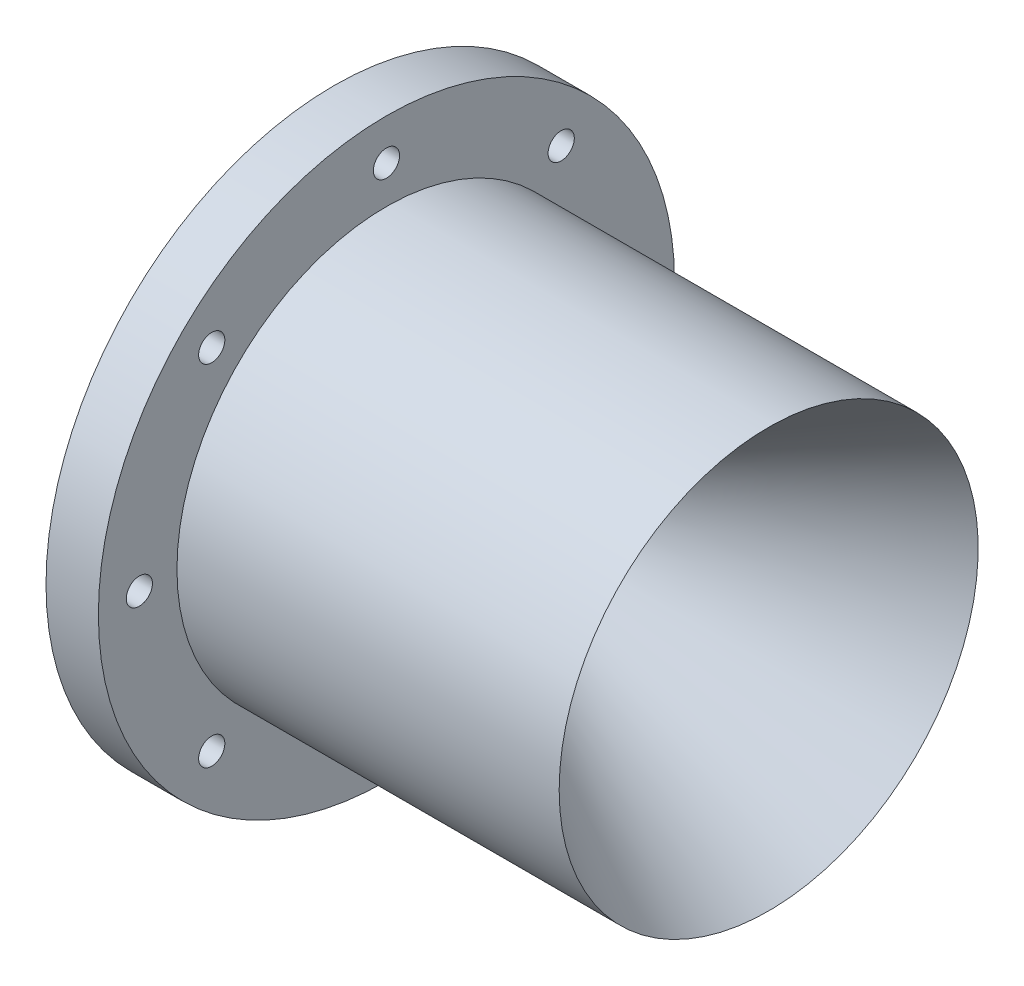
ISO-10303-21;
HEADER;
FILE_DESCRIPTION(('STEP AP214'),'2;1');
FILE_NAME('part.step','',(''),(''),'','','');
FILE_SCHEMA(('AUTOMOTIVE_DESIGN { 1 0 10303 214 1 1 1 1 }'));
ENDSEC;
DATA;
#1=APPLICATION_CONTEXT('core data for automotive mechanical design processes');
#2=APPLICATION_PROTOCOL_DEFINITION('international standard','automotive_design',2000,#1);
#3=PRODUCT_CONTEXT('',#1,'mechanical');
#4=PRODUCT('Part','Part','',(#3));
#5=PRODUCT_RELATED_PRODUCT_CATEGORY('part','',(#4));
#6=PRODUCT_DEFINITION_FORMATION('','',#4);
#7=PRODUCT_DEFINITION_CONTEXT('part definition',#1,'design');
#8=PRODUCT_DEFINITION('design','',#6,#7);
#9=PRODUCT_DEFINITION_SHAPE('','',#8);
#10=(LENGTH_UNIT() NAMED_UNIT(*) SI_UNIT(.MILLI.,.METRE.));
#11=(NAMED_UNIT(*) PLANE_ANGLE_UNIT() SI_UNIT($,.RADIAN.));
#12=(NAMED_UNIT(*) SI_UNIT($,.STERADIAN.) SOLID_ANGLE_UNIT());
#13=UNCERTAINTY_MEASURE_WITH_UNIT(LENGTH_MEASURE(1.E-05),#10,'distance_accuracy_value','');
#14=(GEOMETRIC_REPRESENTATION_CONTEXT(3) GLOBAL_UNCERTAINTY_ASSIGNED_CONTEXT((#13)) GLOBAL_UNIT_ASSIGNED_CONTEXT((#10,
#11,#12)) REPRESENTATION_CONTEXT('',''));
#15=CARTESIAN_POINT('',(0.,0.,0.));
#16=DIRECTION('',(0.,0.,1.));
#17=DIRECTION('',(1.,0.,0.));
#18=AXIS2_PLACEMENT_3D('',#15,#16,#17);
#19=CARTESIAN_POINT('',(-33.0472668619156,50.8,0.));
#20=DIRECTION('',(1.,0.,0.));
#21=DIRECTION('',(0.,0.,-1.));
#22=AXIS2_PLACEMENT_3D('',#19,#20,#21);
#23=PLANE('',#22);
#24=CARTESIAN_POINT('',(-33.0472668619156,0.,0.));
#25=DIRECTION('',(-1.,0.,0.));
#26=DIRECTION('',(0.,0.,1.));
#27=AXIS2_PLACEMENT_3D('',#24,#25,#26);
#28=CIRCLE('',#27,41.275);
#29=CARTESIAN_POINT('',(-33.0472668619156,0.,41.275));
#30=VERTEX_POINT('',#29);
#31=EDGE_CURVE('E55',#30,#30,#28,.T.);
#32=ORIENTED_EDGE('',*,*,#31,.F.);
#33=EDGE_LOOP('',(#32));
#34=FACE_BOUND('',#33,.T.);
#35=CARTESIAN_POINT('',(-33.0472668619156,0.,0.));
#36=DIRECTION('',(-1.,0.,0.));
#37=DIRECTION('',(0.,0.,1.));
#38=AXIS2_PLACEMENT_3D('',#35,#36,#37);
#39=CIRCLE('',#38,47.625);
#40=CARTESIAN_POINT('',(-33.0472668619156,0.,47.625));
#41=VERTEX_POINT('',#40);
#42=EDGE_CURVE('E68',#41,#41,#39,.T.);
#43=ORIENTED_EDGE('',*,*,#42,.T.);
#44=EDGE_LOOP('',(#43));
#45=FACE_BOUND('',#44,.T.);
#46=ADVANCED_FACE('F32',(#34,#45),#23,.F.);
#47=CARTESIAN_POINT('',(0.,0.,0.));
#48=DIRECTION('',(-1.,0.,0.));
#49=DIRECTION('',(0.,0.,1.));
#50=AXIS2_PLACEMENT_3D('',#47,#48,#49);
#51=CYLINDRICAL_SURFACE('',#50,7.9375);
#52=CARTESIAN_POINT('',(0.,0.,0.));
#53=DIRECTION('',(-1.,0.,0.));
#54=DIRECTION('',(0.,0.,1.));
#55=AXIS2_PLACEMENT_3D('',#52,#53,#54);
#56=CIRCLE('',#55,7.9375);
#57=CARTESIAN_POINT('',(0.,0.,7.9375));
#58=VERTEX_POINT('',#57);
#59=EDGE_CURVE('E10',#58,#58,#56,.T.);
#60=ORIENTED_EDGE('',*,*,#59,.F.);
#61=EDGE_LOOP('',(#60));
#62=FACE_BOUND('',#61,.T.);
#63=CARTESIAN_POINT('',(-12.7,0.,0.));
#64=DIRECTION('',(-1.,0.,0.));
#65=DIRECTION('',(0.,0.,1.));
#66=AXIS2_PLACEMENT_3D('',#63,#64,#65);
#67=CIRCLE('',#66,7.9375);
#68=CARTESIAN_POINT('',(-12.7,0.,7.9375));
#69=VERTEX_POINT('',#68);
#70=EDGE_CURVE('E58',#69,#69,#67,.T.);
#71=ORIENTED_EDGE('',*,*,#70,.T.);
#72=EDGE_LOOP('',(#71));
#73=FACE_BOUND('',#72,.T.);
#74=ADVANCED_FACE('F34',(#62,#73),#51,.F.);
#75=CARTESIAN_POINT('',(0.,0.,0.));
#76=DIRECTION('',(1.,0.,0.));
#77=DIRECTION('',(0.,0.,-1.));
#78=AXIS2_PLACEMENT_3D('',#75,#76,#77);
#79=CONICAL_SURFACE('',#78,7.9375,0.534993353531431);
#80=CARTESIAN_POINT('',(72.3241560558228,0.,0.));
#81=DIRECTION('',(-1.,0.,0.));
#82=DIRECTION('',(0.,0.,1.));
#83=AXIS2_PLACEMENT_3D('',#80,#81,#82);
#84=CIRCLE('',#83,50.8);
#85=CARTESIAN_POINT('',(72.3241560558228,0.,50.8));
#86=VERTEX_POINT('',#85);
#87=EDGE_CURVE('E39',#86,#86,#84,.T.);
#88=ORIENTED_EDGE('',*,*,#87,.F.);
#89=EDGE_LOOP('',(#88));
#90=FACE_BOUND('',#89,.T.);
#91=ORIENTED_EDGE('',*,*,#59,.T.);
#92=EDGE_LOOP('',(#91));
#93=FACE_BOUND('',#92,.T.);
#94=ADVANCED_FACE('F163',(#90,#93),#79,.F.);
#95=CARTESIAN_POINT('',(0.,0.,0.));
#96=DIRECTION('',(-1.,0.,0.));
#97=DIRECTION('',(0.,0.,1.));
#98=AXIS2_PLACEMENT_3D('',#95,#96,#97);
#99=CYLINDRICAL_SURFACE('',#98,50.8);
#100=CARTESIAN_POINT('',(-20.3472668619156,0.,0.));
#101=DIRECTION('',(-1.,0.,0.));
#102=DIRECTION('',(0.,0.,1.));
#103=AXIS2_PLACEMENT_3D('',#100,#101,#102);
#104=CIRCLE('',#103,50.8);
#105=CARTESIAN_POINT('',(-20.3472668619156,0.,50.8));
#106=VERTEX_POINT('',#105);
#107=EDGE_CURVE('E43',#106,#106,#104,.T.);
#108=ORIENTED_EDGE('',*,*,#107,.F.);
#109=EDGE_LOOP('',(#108));
#110=FACE_BOUND('',#109,.T.);
#111=ORIENTED_EDGE('',*,*,#87,.T.);
#112=EDGE_LOOP('',(#111));
#113=FACE_BOUND('',#112,.T.);
#114=ADVANCED_FACE('F157',(#110,#113),#99,.T.);
#115=CARTESIAN_POINT('',(-20.3472668619156,69.85,0.));
#116=DIRECTION('',(-1.,0.,0.));
#117=DIRECTION('',(0.,0.,1.));
#118=AXIS2_PLACEMENT_3D('',#115,#116,#117);
#119=PLANE('',#118);
#120=CARTESIAN_POINT('',(-20.3472668619156,59.9186,0.));
#121=DIRECTION('',(-1.,0.,0.));
#122=DIRECTION('',(0.,0.,1.));
#123=AXIS2_PLACEMENT_3D('',#120,#121,#122);
#124=CIRCLE('',#123,3.175);
#125=CARTESIAN_POINT('',(-20.3472668619156,59.9186,3.175));
#126=VERTEX_POINT('',#125);
#127=EDGE_CURVE('E71',#126,#126,#124,.F.);
#128=ORIENTED_EDGE('',*,*,#127,.F.);
#129=EDGE_LOOP('',(#128));
#130=FACE_BOUND('',#129,.T.);
#131=CARTESIAN_POINT('',(-20.3472668619156,42.3688483792054,42.3688483792047));
#132=DIRECTION('',(-1.,0.,0.));
#133=DIRECTION('',(0.,0.,1.));
#134=AXIS2_PLACEMENT_3D('',#131,#132,#133);
#135=CIRCLE('',#134,3.17500000000024);
#136=CARTESIAN_POINT('',(-20.3472668619156,42.3688483792054,45.543848379205));
#137=VERTEX_POINT('',#136);
#138=EDGE_CURVE('E111',#137,#137,#135,.F.);
#139=ORIENTED_EDGE('',*,*,#138,.F.);
#140=EDGE_LOOP('',(#139));
#141=FACE_BOUND('',#140,.T.);
#142=CARTESIAN_POINT('',(-20.3472668619156,1.61747136534687E-12,59.9186000000016));
#143=DIRECTION('',(-1.,0.,0.));
#144=DIRECTION('',(0.,0.,1.));
#145=AXIS2_PLACEMENT_3D('',#142,#143,#144);
#146=CIRCLE('',#145,3.175);
#147=CARTESIAN_POINT('',(-20.3472668619156,1.61747136534687E-12,63.0936000000016));
#148=VERTEX_POINT('',#147);
#149=EDGE_CURVE('E105',#148,#148,#146,.F.);
#150=ORIENTED_EDGE('',*,*,#149,.F.);
#151=EDGE_LOOP('',(#150));
#152=FACE_BOUND('',#151,.T.);
#153=CARTESIAN_POINT('',(-20.3472668619156,-42.3688483792031,42.368848379207));
#154=DIRECTION('',(-1.,0.,0.));
#155=DIRECTION('',(0.,0.,1.));
#156=AXIS2_PLACEMENT_3D('',#153,#154,#155);
#157=CIRCLE('',#156,3.175);
#158=CARTESIAN_POINT('',(-20.3472668619156,-42.3688483792031,45.543848379207));
#159=VERTEX_POINT('',#158);
#160=EDGE_CURVE('E99',#159,#159,#157,.F.);
#161=ORIENTED_EDGE('',*,*,#160,.F.);
#162=EDGE_LOOP('',(#161));
#163=FACE_BOUND('',#162,.T.);
#164=CARTESIAN_POINT('',(-20.3472668619156,-59.9186,3.23494273069374E-12));
#165=DIRECTION('',(-1.,0.,0.));
#166=DIRECTION('',(0.,0.,1.));
#167=AXIS2_PLACEMENT_3D('',#164,#165,#166);
#168=CIRCLE('',#167,3.175);
#169=CARTESIAN_POINT('',(-20.3472668619156,-59.9186,3.17500000000323));
#170=VERTEX_POINT('',#169);
#171=EDGE_CURVE('E93',#170,#170,#168,.F.);
#172=ORIENTED_EDGE('',*,*,#171,.F.);
#173=EDGE_LOOP('',(#172));
#174=FACE_BOUND('',#173,.T.);
#175=CARTESIAN_POINT('',(-20.3472668619156,-42.3688483792054,-42.3688483792015));
#176=DIRECTION('',(-1.,0.,0.));
#177=DIRECTION('',(0.,0.,1.));
#178=AXIS2_PLACEMENT_3D('',#175,#176,#177);
#179=CIRCLE('',#178,3.175);
#180=CARTESIAN_POINT('',(-20.3472668619156,-42.3688483792054,-39.1938483792015));
#181=VERTEX_POINT('',#180);
#182=EDGE_CURVE('E87',#181,#181,#179,.F.);
#183=ORIENTED_EDGE('',*,*,#182,.F.);
#184=EDGE_LOOP('',(#183));
#185=FACE_BOUND('',#184,.T.);
#186=CARTESIAN_POINT('',(-20.3472668619156,-1.62480927751681E-12,-59.9185999999984));
#187=DIRECTION('',(-1.,0.,0.));
#188=DIRECTION('',(0.,0.,1.));
#189=AXIS2_PLACEMENT_3D('',#186,#187,#188);
#190=CIRCLE('',#189,3.175);
#191=CARTESIAN_POINT('',(-20.3472668619156,-1.62480927751681E-12,-56.7435999999984));
#192=VERTEX_POINT('',#191);
#193=EDGE_CURVE('E81',#192,#192,#190,.F.);
#194=ORIENTED_EDGE('',*,*,#193,.F.);
#195=EDGE_LOOP('',(#194));
#196=FACE_BOUND('',#195,.T.);
#197=CARTESIAN_POINT('',(-20.3472668619156,42.3688483792031,-42.3688483792038));
#198=DIRECTION('',(-1.,0.,0.));
#199=DIRECTION('',(0.,0.,1.));
#200=AXIS2_PLACEMENT_3D('',#197,#198,#199);
#201=CIRCLE('',#200,3.175);
#202=CARTESIAN_POINT('',(-20.3472668619156,42.3688483792031,-39.1938483792038));
#203=VERTEX_POINT('',#202);
#204=EDGE_CURVE('E74',#203,#203,#201,.F.);
#205=ORIENTED_EDGE('',*,*,#204,.F.);
#206=EDGE_LOOP('',(#205));
#207=FACE_BOUND('',#206,.T.);
#208=CARTESIAN_POINT('',(-20.3472668619156,0.,0.));
#209=DIRECTION('',(-1.,0.,0.));
#210=DIRECTION('',(0.,0.,1.));
#211=AXIS2_PLACEMENT_3D('',#208,#209,#210);
#212=CIRCLE('',#211,69.85);
#213=CARTESIAN_POINT('',(-20.3472668619156,0.,69.85));
#214=VERTEX_POINT('',#213);
#215=EDGE_CURVE('E47',#214,#214,#212,.T.);
#216=ORIENTED_EDGE('',*,*,#215,.F.);
#217=EDGE_LOOP('',(#216));
#218=FACE_BOUND('',#217,.T.);
#219=ORIENTED_EDGE('',*,*,#107,.T.);
#220=EDGE_LOOP('',(#219));
#221=FACE_BOUND('',#220,.T.);
#222=ADVANCED_FACE('F151',(#130,#141,#152,#163,#174,#185,#196,#207,#218,#221),#119,.F.);
#223=CARTESIAN_POINT('',(0.,0.,0.));
#224=DIRECTION('',(-1.,0.,0.));
#225=DIRECTION('',(0.,0.,1.));
#226=AXIS2_PLACEMENT_3D('',#223,#224,#225);
#227=CYLINDRICAL_SURFACE('',#226,69.85);
#228=CARTESIAN_POINT('',(-33.0472668619156,0.,0.));
#229=DIRECTION('',(-1.,0.,0.));
#230=DIRECTION('',(0.,0.,1.));
#231=AXIS2_PLACEMENT_3D('',#228,#229,#230);
#232=CIRCLE('',#231,69.85);
#233=CARTESIAN_POINT('',(-33.0472668619156,0.,69.85));
#234=VERTEX_POINT('',#233);
#235=EDGE_CURVE('E52',#234,#234,#232,.T.);
#236=ORIENTED_EDGE('',*,*,#235,.F.);
#237=EDGE_LOOP('',(#236));
#238=FACE_BOUND('',#237,.T.);
#239=ORIENTED_EDGE('',*,*,#215,.T.);
#240=EDGE_LOOP('',(#239));
#241=FACE_BOUND('',#240,.T.);
#242=ADVANCED_FACE('F129',(#238,#241),#227,.T.);
#243=CARTESIAN_POINT('',(-33.0472668619156,59.9186,0.));
#244=DIRECTION('',(-1.,0.,0.));
#245=DIRECTION('',(0.,0.,1.));
#246=AXIS2_PLACEMENT_3D('',#243,#244,#245);
#247=CIRCLE('',#246,3.175);
#248=CARTESIAN_POINT('',(-33.0472668619156,59.9186,3.175));
#249=VERTEX_POINT('',#248);
#250=EDGE_CURVE('E114',#249,#249,#247,.T.);
#251=ORIENTED_EDGE('',*,*,#250,.F.);
#252=EDGE_LOOP('',(#251));
#253=FACE_BOUND('',#252,.T.);
#254=CARTESIAN_POINT('',(-33.0472668619156,42.3688483792054,42.3688483792047));
#255=DIRECTION('',(-1.,0.,0.));
#256=DIRECTION('',(0.,0.,1.));
#257=AXIS2_PLACEMENT_3D('',#254,#255,#256);
#258=CIRCLE('',#257,3.17500000000024);
#259=CARTESIAN_POINT('',(-33.0472668619156,42.3688483792054,45.543848379205));
#260=VERTEX_POINT('',#259);
#261=EDGE_CURVE('E108',#260,#260,#258,.T.);
#262=ORIENTED_EDGE('',*,*,#261,.F.);
#263=EDGE_LOOP('',(#262));
#264=FACE_BOUND('',#263,.T.);
#265=CARTESIAN_POINT('',(-33.0472668619156,1.61747136534687E-12,59.9186000000016));
#266=DIRECTION('',(-1.,0.,0.));
#267=DIRECTION('',(0.,0.,1.));
#268=AXIS2_PLACEMENT_3D('',#265,#266,#267);
#269=CIRCLE('',#268,3.175);
#270=CARTESIAN_POINT('',(-33.0472668619156,1.61747136534687E-12,63.0936000000016));
#271=VERTEX_POINT('',#270);
#272=EDGE_CURVE('E102',#271,#271,#269,.T.);
#273=ORIENTED_EDGE('',*,*,#272,.F.);
#274=EDGE_LOOP('',(#273));
#275=FACE_BOUND('',#274,.T.);
#276=CARTESIAN_POINT('',(-33.0472668619156,-42.3688483792031,42.368848379207));
#277=DIRECTION('',(-1.,0.,0.));
#278=DIRECTION('',(0.,0.,1.));
#279=AXIS2_PLACEMENT_3D('',#276,#277,#278);
#280=CIRCLE('',#279,3.175);
#281=CARTESIAN_POINT('',(-33.0472668619156,-42.3688483792031,45.543848379207));
#282=VERTEX_POINT('',#281);
#283=EDGE_CURVE('E96',#282,#282,#280,.T.);
#284=ORIENTED_EDGE('',*,*,#283,.F.);
#285=EDGE_LOOP('',(#284));
#286=FACE_BOUND('',#285,.T.);
#287=CARTESIAN_POINT('',(-33.0472668619156,-59.9186,3.23494273069374E-12));
#288=DIRECTION('',(-1.,0.,0.));
#289=DIRECTION('',(0.,0.,1.));
#290=AXIS2_PLACEMENT_3D('',#287,#288,#289);
#291=CIRCLE('',#290,3.175);
#292=CARTESIAN_POINT('',(-33.0472668619156,-59.9186,3.17500000000323));
#293=VERTEX_POINT('',#292);
#294=EDGE_CURVE('E90',#293,#293,#291,.T.);
#295=ORIENTED_EDGE('',*,*,#294,.F.);
#296=EDGE_LOOP('',(#295));
#297=FACE_BOUND('',#296,.T.);
#298=CARTESIAN_POINT('',(-33.0472668619156,-42.3688483792054,-42.3688483792015));
#299=DIRECTION('',(-1.,0.,0.));
#300=DIRECTION('',(0.,0.,1.));
#301=AXIS2_PLACEMENT_3D('',#298,#299,#300);
#302=CIRCLE('',#301,3.175);
#303=CARTESIAN_POINT('',(-33.0472668619156,-42.3688483792054,-39.1938483792015));
#304=VERTEX_POINT('',#303);
#305=EDGE_CURVE('E84',#304,#304,#302,.T.);
#306=ORIENTED_EDGE('',*,*,#305,.F.);
#307=EDGE_LOOP('',(#306));
#308=FACE_BOUND('',#307,.T.);
#309=CARTESIAN_POINT('',(-33.0472668619156,-1.62480927751681E-12,-59.9185999999984));
#310=DIRECTION('',(-1.,0.,0.));
#311=DIRECTION('',(0.,0.,1.));
#312=AXIS2_PLACEMENT_3D('',#309,#310,#311);
#313=CIRCLE('',#312,3.175);
#314=CARTESIAN_POINT('',(-33.0472668619156,-1.62480927751681E-12,-56.7435999999984));
#315=VERTEX_POINT('',#314);
#316=EDGE_CURVE('E77',#315,#315,#313,.T.);
#317=ORIENTED_EDGE('',*,*,#316,.F.);
#318=EDGE_LOOP('',(#317));
#319=FACE_BOUND('',#318,.T.);
#320=CARTESIAN_POINT('',(-33.0472668619156,42.3688483792031,-42.3688483792038));
#321=DIRECTION('',(-1.,0.,0.));
#322=DIRECTION('',(0.,0.,1.));
#323=AXIS2_PLACEMENT_3D('',#320,#321,#322);
#324=CIRCLE('',#323,3.175);
#325=CARTESIAN_POINT('',(-33.0472668619156,42.3688483792031,-39.1938483792038));
#326=VERTEX_POINT('',#325);
#327=EDGE_CURVE('E78',#326,#326,#324,.T.);
#328=ORIENTED_EDGE('',*,*,#327,.F.);
#329=EDGE_LOOP('',(#328));
#330=FACE_BOUND('',#329,.T.);
#331=CARTESIAN_POINT('',(-33.0472668619156,0.,0.));
#332=DIRECTION('',(-1.,0.,0.));
#333=DIRECTION('',(0.,0.,1.));
#334=AXIS2_PLACEMENT_3D('',#331,#332,#333);
#335=CIRCLE('',#334,49.53);
#336=CARTESIAN_POINT('',(-33.0472668619156,0.,49.53));
#337=VERTEX_POINT('',#336);
#338=EDGE_CURVE('E62',#337,#337,#335,.T.);
#339=ORIENTED_EDGE('',*,*,#338,.F.);
#340=EDGE_LOOP('',(#339));
#341=FACE_BOUND('',#340,.T.);
#342=ORIENTED_EDGE('',*,*,#235,.T.);
#343=EDGE_LOOP('',(#342));
#344=FACE_BOUND('',#343,.T.);
#345=ADVANCED_FACE('F125',(#253,#264,#275,#286,#297,#308,#319,#330,#341,#344),#23,.F.);
#346=CARTESIAN_POINT('',(-33.0472668619156,0.,0.));
#347=DIRECTION('',(-1.,0.,0.));
#348=DIRECTION('',(0.,0.,1.));
#349=AXIS2_PLACEMENT_3D('',#346,#347,#348);
#350=CONICAL_SURFACE('',#349,41.275,1.02280730700641);
#351=ORIENTED_EDGE('',*,*,#70,.F.);
#352=EDGE_LOOP('',(#351));
#353=FACE_BOUND('',#352,.T.);
#354=ORIENTED_EDGE('',*,*,#31,.T.);
#355=EDGE_LOOP('',(#354));
#356=FACE_BOUND('',#355,.T.);
#357=ADVANCED_FACE('F128',(#353,#356),#350,.F.);
#358=CARTESIAN_POINT('',(-31.9296668619156,0.,0.));
#359=DIRECTION('',(-1.,0.,0.));
#360=DIRECTION('',(0.,0.,1.));
#361=AXIS2_PLACEMENT_3D('',#358,#359,#360);
#362=CYLINDRICAL_SURFACE('',#361,49.53);
#363=CARTESIAN_POINT('',(-31.9296668619156,0.,0.));
#364=DIRECTION('',(-1.,0.,0.));
#365=DIRECTION('',(0.,0.,1.));
#366=AXIS2_PLACEMENT_3D('',#363,#364,#365);
#367=CIRCLE('',#366,49.53);
#368=CARTESIAN_POINT('',(-31.9296668619156,0.,49.53));
#369=VERTEX_POINT('',#368);
#370=EDGE_CURVE('E61',#369,#369,#367,.T.);
#371=ORIENTED_EDGE('',*,*,#370,.F.);
#372=EDGE_LOOP('',(#371));
#373=FACE_BOUND('',#372,.T.);
#374=ORIENTED_EDGE('',*,*,#338,.T.);
#375=EDGE_LOOP('',(#374));
#376=FACE_BOUND('',#375,.T.);
#377=ADVANCED_FACE('F180',(#373,#376),#362,.F.);
#378=CARTESIAN_POINT('',(-31.9296668619156,0.,0.));
#379=DIRECTION('',(-1.,0.,0.));
#380=DIRECTION('',(0.,0.,1.));
#381=AXIS2_PLACEMENT_3D('',#378,#379,#380);
#382=PLANE('',#381);
#383=CARTESIAN_POINT('',(-31.9296668619156,0.,0.));
#384=DIRECTION('',(-1.,0.,0.));
#385=DIRECTION('',(0.,0.,1.));
#386=AXIS2_PLACEMENT_3D('',#383,#384,#385);
#387=CIRCLE('',#386,47.625);
#388=CARTESIAN_POINT('',(-31.9296668619156,0.,47.625));
#389=VERTEX_POINT('',#388);
#390=EDGE_CURVE('E65',#389,#389,#387,.T.);
#391=ORIENTED_EDGE('',*,*,#390,.F.);
#392=EDGE_LOOP('',(#391));
#393=FACE_BOUND('',#392,.T.);
#394=ORIENTED_EDGE('',*,*,#370,.T.);
#395=EDGE_LOOP('',(#394));
#396=FACE_BOUND('',#395,.T.);
#397=ADVANCED_FACE('F184',(#393,#396),#382,.T.);
#398=CARTESIAN_POINT('',(-31.9296668619156,0.,0.));
#399=DIRECTION('',(-1.,0.,0.));
#400=DIRECTION('',(0.,0.,1.));
#401=AXIS2_PLACEMENT_3D('',#398,#399,#400);
#402=CYLINDRICAL_SURFACE('',#401,47.625);
#403=ORIENTED_EDGE('',*,*,#390,.T.);
#404=EDGE_LOOP('',(#403));
#405=FACE_BOUND('',#404,.T.);
#406=ORIENTED_EDGE('',*,*,#42,.F.);
#407=EDGE_LOOP('',(#406));
#408=FACE_BOUND('',#407,.T.);
#409=ADVANCED_FACE('F188',(#405,#408),#402,.T.);
#410=CARTESIAN_POINT('',(72.3251560558228,42.3688483792031,-42.3688483792038));
#411=DIRECTION('',(-1.,0.,0.));
#412=DIRECTION('',(0.,0.,1.));
#413=AXIS2_PLACEMENT_3D('',#410,#411,#412);
#414=CYLINDRICAL_SURFACE('',#413,3.175);
#415=ORIENTED_EDGE('',*,*,#327,.T.);
#416=EDGE_LOOP('',(#415));
#417=FACE_BOUND('',#416,.T.);
#418=ORIENTED_EDGE('',*,*,#204,.T.);
#419=EDGE_LOOP('',(#418));
#420=FACE_BOUND('',#419,.T.);
#421=ADVANCED_FACE('F192',(#417,#420),#414,.F.);
#422=CARTESIAN_POINT('',(72.3251560558228,-1.62480927751681E-12,-59.9185999999984));
#423=DIRECTION('',(-1.,0.,0.));
#424=DIRECTION('',(0.,0.,1.));
#425=AXIS2_PLACEMENT_3D('',#422,#423,#424);
#426=CYLINDRICAL_SURFACE('',#425,3.175);
#427=ORIENTED_EDGE('',*,*,#316,.T.);
#428=EDGE_LOOP('',(#427));
#429=FACE_BOUND('',#428,.T.);
#430=ORIENTED_EDGE('',*,*,#193,.T.);
#431=EDGE_LOOP('',(#430));
#432=FACE_BOUND('',#431,.T.);
#433=ADVANCED_FACE('F196',(#429,#432),#426,.F.);
#434=CARTESIAN_POINT('',(72.3251560558228,-42.3688483792054,-42.3688483792015));
#435=DIRECTION('',(-1.,0.,0.));
#436=DIRECTION('',(0.,0.,1.));
#437=AXIS2_PLACEMENT_3D('',#434,#435,#436);
#438=CYLINDRICAL_SURFACE('',#437,3.175);
#439=ORIENTED_EDGE('',*,*,#305,.T.);
#440=EDGE_LOOP('',(#439));
#441=FACE_BOUND('',#440,.T.);
#442=ORIENTED_EDGE('',*,*,#182,.T.);
#443=EDGE_LOOP('',(#442));
#444=FACE_BOUND('',#443,.T.);
#445=ADVANCED_FACE('F200',(#441,#444),#438,.F.);
#446=CARTESIAN_POINT('',(72.3251560558228,-59.9186,3.23494273069374E-12));
#447=DIRECTION('',(-1.,0.,0.));
#448=DIRECTION('',(0.,0.,1.));
#449=AXIS2_PLACEMENT_3D('',#446,#447,#448);
#450=CYLINDRICAL_SURFACE('',#449,3.175);
#451=ORIENTED_EDGE('',*,*,#294,.T.);
#452=EDGE_LOOP('',(#451));
#453=FACE_BOUND('',#452,.T.);
#454=ORIENTED_EDGE('',*,*,#171,.T.);
#455=EDGE_LOOP('',(#454));
#456=FACE_BOUND('',#455,.T.);
#457=ADVANCED_FACE('F204',(#453,#456),#450,.F.);
#458=CARTESIAN_POINT('',(72.3251560558228,-42.3688483792031,42.368848379207));
#459=DIRECTION('',(-1.,0.,0.));
#460=DIRECTION('',(0.,0.,1.));
#461=AXIS2_PLACEMENT_3D('',#458,#459,#460);
#462=CYLINDRICAL_SURFACE('',#461,3.175);
#463=ORIENTED_EDGE('',*,*,#283,.T.);
#464=EDGE_LOOP('',(#463));
#465=FACE_BOUND('',#464,.T.);
#466=ORIENTED_EDGE('',*,*,#160,.T.);
#467=EDGE_LOOP('',(#466));
#468=FACE_BOUND('',#467,.T.);
#469=ADVANCED_FACE('F208',(#465,#468),#462,.F.);
#470=CARTESIAN_POINT('',(72.3251560558228,1.61747136534687E-12,59.9186000000016));
#471=DIRECTION('',(-1.,0.,0.));
#472=DIRECTION('',(0.,0.,1.));
#473=AXIS2_PLACEMENT_3D('',#470,#471,#472);
#474=CYLINDRICAL_SURFACE('',#473,3.175);
#475=ORIENTED_EDGE('',*,*,#272,.T.);
#476=EDGE_LOOP('',(#475));
#477=FACE_BOUND('',#476,.T.);
#478=ORIENTED_EDGE('',*,*,#149,.T.);
#479=EDGE_LOOP('',(#478));
#480=FACE_BOUND('',#479,.T.);
#481=ADVANCED_FACE('F212',(#477,#480),#474,.F.);
#482=CARTESIAN_POINT('',(72.3251560558228,42.3688483792054,42.3688483792047));
#483=DIRECTION('',(-1.,0.,0.));
#484=DIRECTION('',(0.,0.,1.));
#485=AXIS2_PLACEMENT_3D('',#482,#483,#484);
#486=CYLINDRICAL_SURFACE('',#485,3.17500000000024);
#487=ORIENTED_EDGE('',*,*,#261,.T.);
#488=EDGE_LOOP('',(#487));
#489=FACE_BOUND('',#488,.T.);
#490=ORIENTED_EDGE('',*,*,#138,.T.);
#491=EDGE_LOOP('',(#490));
#492=FACE_BOUND('',#491,.T.);
#493=ADVANCED_FACE('F216',(#489,#492),#486,.F.);
#494=CARTESIAN_POINT('',(72.3251560558228,59.9186,0.));
#495=DIRECTION('',(-1.,0.,0.));
#496=DIRECTION('',(0.,0.,1.));
#497=AXIS2_PLACEMENT_3D('',#494,#495,#496);
#498=CYLINDRICAL_SURFACE('',#497,3.175);
#499=ORIENTED_EDGE('',*,*,#250,.T.);
#500=EDGE_LOOP('',(#499));
#501=FACE_BOUND('',#500,.T.);
#502=ORIENTED_EDGE('',*,*,#127,.T.);
#503=EDGE_LOOP('',(#502));
#504=FACE_BOUND('',#503,.T.);
#505=ADVANCED_FACE('F122',(#501,#504),#498,.F.);
#506=CLOSED_SHELL('',(#46,#74,#94,#114,#222,#242,#345,#357,#377,#397,#409,#421,#433,#445,#457,
#469,#481,#493,#505));
#507=MANIFOLD_SOLID_BREP('B2',#506);
#508=ADVANCED_BREP_SHAPE_REPRESENTATION('',(#18,#507),#14);
#509=SHAPE_DEFINITION_REPRESENTATION(#9,#508);
ENDSEC;
END-ISO-10303-21;
